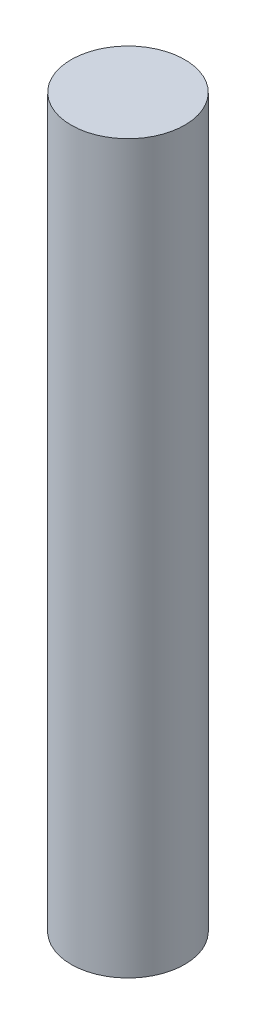
ISO-10303-21;
HEADER;
FILE_DESCRIPTION(('STEP AP214'),'2;1');
FILE_NAME('part.step','',(''),(''),'','','');
FILE_SCHEMA(('AUTOMOTIVE_DESIGN { 1 0 10303 214 1 1 1 1 }'));
ENDSEC;
DATA;
#1=APPLICATION_CONTEXT('core data for automotive mechanical design processes');
#2=APPLICATION_PROTOCOL_DEFINITION('international standard','automotive_design',2000,#1);
#3=PRODUCT_CONTEXT('',#1,'mechanical');
#4=PRODUCT('Part','Part','',(#3));
#5=PRODUCT_RELATED_PRODUCT_CATEGORY('part','',(#4));
#6=PRODUCT_DEFINITION_FORMATION('','',#4);
#7=PRODUCT_DEFINITION_CONTEXT('part definition',#1,'design');
#8=PRODUCT_DEFINITION('design','',#6,#7);
#9=PRODUCT_DEFINITION_SHAPE('','',#8);
#10=(LENGTH_UNIT() NAMED_UNIT(*) SI_UNIT(.MILLI.,.METRE.));
#11=(NAMED_UNIT(*) PLANE_ANGLE_UNIT() SI_UNIT($,.RADIAN.));
#12=(NAMED_UNIT(*) SI_UNIT($,.STERADIAN.) SOLID_ANGLE_UNIT());
#13=UNCERTAINTY_MEASURE_WITH_UNIT(LENGTH_MEASURE(1.E-05),#10,'distance_accuracy_value','');
#14=(GEOMETRIC_REPRESENTATION_CONTEXT(3) GLOBAL_UNCERTAINTY_ASSIGNED_CONTEXT((#13)) GLOBAL_UNIT_ASSIGNED_CONTEXT((#10,
#11,#12)) REPRESENTATION_CONTEXT('',''));
#15=CARTESIAN_POINT('',(0.,0.,0.));
#16=DIRECTION('',(0.,0.,1.));
#17=DIRECTION('',(1.,0.,0.));
#18=AXIS2_PLACEMENT_3D('',#15,#16,#17);
#19=CARTESIAN_POINT('',(0.,12.7,0.));
#20=DIRECTION('',(0.,-1.,0.));
#21=DIRECTION('',(0.,0.,-1.));
#22=AXIS2_PLACEMENT_3D('',#19,#20,#21);
#23=CYLINDRICAL_SURFACE('',#22,0.9921875);
#24=CARTESIAN_POINT('',(0.,12.7,0.));
#25=DIRECTION('',(0.,1.,0.));
#26=DIRECTION('',(0.,0.,1.));
#27=AXIS2_PLACEMENT_3D('',#24,#25,#26);
#28=CIRCLE('',#27,0.9921875);
#29=CARTESIAN_POINT('',(0.,12.7,0.9921875));
#30=VERTEX_POINT('',#29);
#31=EDGE_CURVE('E10',#30,#30,#28,.T.);
#32=ORIENTED_EDGE('',*,*,#31,.F.);
#33=EDGE_LOOP('',(#32));
#34=FACE_BOUND('',#33,.T.);
#35=CARTESIAN_POINT('',(0.,0.,0.));
#36=DIRECTION('',(0.,1.,0.));
#37=DIRECTION('',(0.,0.,1.));
#38=AXIS2_PLACEMENT_3D('',#35,#36,#37);
#39=CIRCLE('',#38,0.9921875);
#40=CARTESIAN_POINT('',(0.,0.,0.9921875));
#41=VERTEX_POINT('',#40);
#42=EDGE_CURVE('E32',#41,#41,#39,.T.);
#43=ORIENTED_EDGE('',*,*,#42,.T.);
#44=EDGE_LOOP('',(#43));
#45=FACE_BOUND('',#44,.T.);
#46=ADVANCED_FACE('F29',(#34,#45),#23,.T.);
#47=CARTESIAN_POINT('',(0.,12.7,0.));
#48=DIRECTION('',(0.,1.,0.));
#49=DIRECTION('',(0.,0.,1.));
#50=AXIS2_PLACEMENT_3D('',#47,#48,#49);
#51=PLANE('',#50);
#52=ORIENTED_EDGE('',*,*,#31,.T.);
#53=EDGE_LOOP('',(#52));
#54=FACE_BOUND('',#53,.T.);
#55=ADVANCED_FACE('F44',(#54),#51,.T.);
#56=CARTESIAN_POINT('',(0.,0.,0.));
#57=DIRECTION('',(0.,1.,0.));
#58=DIRECTION('',(0.,0.,1.));
#59=AXIS2_PLACEMENT_3D('',#56,#57,#58);
#60=PLANE('',#59);
#61=ORIENTED_EDGE('',*,*,#42,.F.);
#62=EDGE_LOOP('',(#61));
#63=FACE_BOUND('',#62,.T.);
#64=ADVANCED_FACE('F42',(#63),#60,.F.);
#65=CLOSED_SHELL('',(#46,#55,#64));
#66=MANIFOLD_SOLID_BREP('B2',#65);
#67=ADVANCED_BREP_SHAPE_REPRESENTATION('',(#18,#66),#14);
#68=SHAPE_DEFINITION_REPRESENTATION(#9,#67);
ENDSEC;
END-ISO-10303-21;
